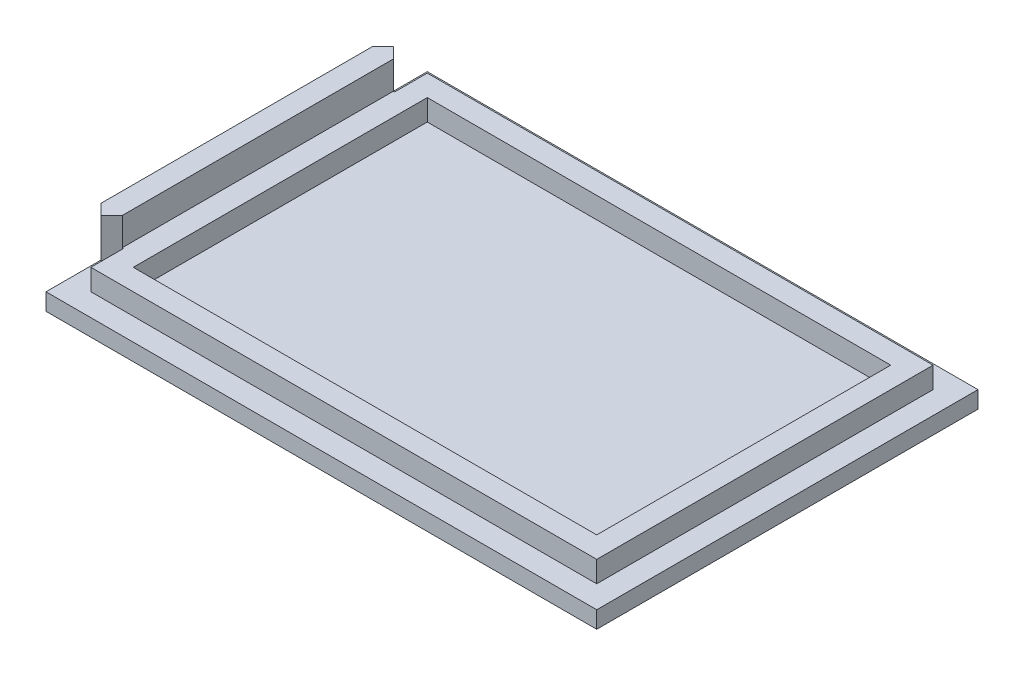
ISO-10303-21;
HEADER;
FILE_DESCRIPTION(('STEP AP214'),'2;1');
FILE_NAME('part.step','',(''),(''),'','','');
FILE_SCHEMA(('AUTOMOTIVE_DESIGN { 1 0 10303 214 1 1 1 1 }'));
ENDSEC;
DATA;
#1=APPLICATION_CONTEXT('core data for automotive mechanical design processes');
#2=APPLICATION_PROTOCOL_DEFINITION('international standard','automotive_design',2000,#1);
#3=PRODUCT_CONTEXT('',#1,'mechanical');
#4=PRODUCT('Part','Part','',(#3));
#5=PRODUCT_RELATED_PRODUCT_CATEGORY('part','',(#4));
#6=PRODUCT_DEFINITION_FORMATION('','',#4);
#7=PRODUCT_DEFINITION_CONTEXT('part definition',#1,'design');
#8=PRODUCT_DEFINITION('design','',#6,#7);
#9=PRODUCT_DEFINITION_SHAPE('','',#8);
#10=(LENGTH_UNIT() NAMED_UNIT(*) SI_UNIT(.MILLI.,.METRE.));
#11=(NAMED_UNIT(*) PLANE_ANGLE_UNIT() SI_UNIT($,.RADIAN.));
#12=(NAMED_UNIT(*) SI_UNIT($,.STERADIAN.) SOLID_ANGLE_UNIT());
#13=UNCERTAINTY_MEASURE_WITH_UNIT(LENGTH_MEASURE(1.E-05),#10,'distance_accuracy_value','');
#14=(GEOMETRIC_REPRESENTATION_CONTEXT(3) GLOBAL_UNCERTAINTY_ASSIGNED_CONTEXT((#13)) GLOBAL_UNIT_ASSIGNED_CONTEXT((#10,
#11,#12)) REPRESENTATION_CONTEXT('',''));
#15=CARTESIAN_POINT('',(0.,0.,0.));
#16=DIRECTION('',(0.,0.,1.));
#17=DIRECTION('',(1.,0.,0.));
#18=AXIS2_PLACEMENT_3D('',#15,#16,#17);
#19=CARTESIAN_POINT('',(0.,2.,0.));
#20=DIRECTION('',(0.,1.,0.));
#21=DIRECTION('',(0.,0.,1.));
#22=AXIS2_PLACEMENT_3D('',#19,#20,#21);
#23=PLANE('',#22);
#24=DIRECTION('',(0.707106781186546,0.,-0.707106781186548));
#25=VECTOR('',#24,1.);
#26=CARTESIAN_POINT('',(-31.25,2.,17.25));
#27=LINE('',#26,#25);
#28=CARTESIAN_POINT('',(-31.25,2.,17.25));
#29=VERTEX_POINT('',#28);
#30=CARTESIAN_POINT('',(-30.,2.,16.));
#31=VERTEX_POINT('',#30);
#32=EDGE_CURVE('E242',#29,#31,#27,.T.);
#33=ORIENTED_EDGE('',*,*,#32,.F.);
#34=DIRECTION('',(0.707106781186547,0.,0.707106781186547));
#35=VECTOR('',#34,1.);
#36=CARTESIAN_POINT('',(-32.5,2.,16.));
#37=LINE('',#36,#35);
#38=CARTESIAN_POINT('',(-32.5,2.,16.));
#39=VERTEX_POINT('',#38);
#40=EDGE_CURVE('E223',#39,#29,#37,.T.);
#41=ORIENTED_EDGE('',*,*,#40,.F.);
#42=DIRECTION('',(0.,0.,1.));
#43=VECTOR('',#42,1.);
#44=CARTESIAN_POINT('',(-32.5,2.,-22.5));
#45=LINE('',#44,#43);
#46=CARTESIAN_POINT('',(-32.5,2.,22.5));
#47=VERTEX_POINT('',#46);
#48=EDGE_CURVE('E314',#39,#47,#45,.T.);
#49=ORIENTED_EDGE('',*,*,#48,.T.);
#50=DIRECTION('',(1.,0.,0.));
#51=VECTOR('',#50,1.);
#52=CARTESIAN_POINT('',(-32.5,2.,22.5));
#53=LINE('',#52,#51);
#54=CARTESIAN_POINT('',(32.5,2.,22.5));
#55=VERTEX_POINT('',#54);
#56=EDGE_CURVE('E318',#47,#55,#53,.T.);
#57=ORIENTED_EDGE('',*,*,#56,.T.);
#58=DIRECTION('',(0.,0.,-1.));
#59=VECTOR('',#58,1.);
#60=CARTESIAN_POINT('',(32.5,2.,-22.5));
#61=LINE('',#60,#59);
#62=CARTESIAN_POINT('',(32.5,2.,-22.5));
#63=VERTEX_POINT('',#62);
#64=EDGE_CURVE('E308',#55,#63,#61,.T.);
#65=ORIENTED_EDGE('',*,*,#64,.T.);
#66=DIRECTION('',(-1.,0.,0.));
#67=VECTOR('',#66,1.);
#68=CARTESIAN_POINT('',(-32.5,2.,-22.5));
#69=LINE('',#68,#67);
#70=CARTESIAN_POINT('',(-32.5,2.,-22.5));
#71=VERTEX_POINT('',#70);
#72=EDGE_CURVE('E311',#63,#71,#69,.T.);
#73=ORIENTED_EDGE('',*,*,#72,.T.);
#74=CARTESIAN_POINT('',(-32.5,2.,-16.));
#75=VERTEX_POINT('',#74);
#76=EDGE_CURVE('E315',#71,#75,#45,.T.);
#77=ORIENTED_EDGE('',*,*,#76,.T.);
#78=DIRECTION('',(-0.707106781186546,0.,0.707106781186549));
#79=VECTOR('',#78,1.);
#80=CARTESIAN_POINT('',(-32.5,2.,-16.));
#81=LINE('',#80,#79);
#82=CARTESIAN_POINT('',(-31.25,2.,-17.25));
#83=VERTEX_POINT('',#82);
#84=EDGE_CURVE('E230',#83,#75,#81,.T.);
#85=ORIENTED_EDGE('',*,*,#84,.F.);
#86=DIRECTION('',(-0.707106781186549,0.,-0.707106781186547));
#87=VECTOR('',#86,1.);
#88=CARTESIAN_POINT('',(-31.25,2.,-17.25));
#89=LINE('',#88,#87);
#90=CARTESIAN_POINT('',(-30.,2.,-16.));
#91=VERTEX_POINT('',#90);
#92=EDGE_CURVE('E250',#91,#83,#89,.T.);
#93=ORIENTED_EDGE('',*,*,#92,.F.);
#94=DIRECTION('',(-1.,0.,0.));
#95=VECTOR('',#94,1.);
#96=CARTESIAN_POINT('',(-30.,2.,-16.));
#97=LINE('',#96,#95);
#98=CARTESIAN_POINT('',(-29.85,2.,-16.));
#99=VERTEX_POINT('',#98);
#100=EDGE_CURVE('E247',#99,#91,#97,.T.);
#101=ORIENTED_EDGE('',*,*,#100,.F.);
#102=DIRECTION('',(0.,0.,1.));
#103=VECTOR('',#102,1.);
#104=CARTESIAN_POINT('',(-29.85,2.,19.85));
#105=LINE('',#104,#103);
#106=CARTESIAN_POINT('',(-29.85,2.,-19.85));
#107=VERTEX_POINT('',#106);
#108=EDGE_CURVE('E292',#107,#99,#105,.T.);
#109=ORIENTED_EDGE('',*,*,#108,.F.);
#110=DIRECTION('',(-1.,0.,0.));
#111=VECTOR('',#110,1.);
#112=CARTESIAN_POINT('',(-29.85,2.,-19.85));
#113=LINE('',#112,#111);
#114=CARTESIAN_POINT('',(29.85,2.,-19.85));
#115=VERTEX_POINT('',#114);
#116=EDGE_CURVE('E288',#115,#107,#113,.T.);
#117=ORIENTED_EDGE('',*,*,#116,.F.);
#118=DIRECTION('',(0.,0.,-1.));
#119=VECTOR('',#118,1.);
#120=CARTESIAN_POINT('',(29.85,2.,19.85));
#121=LINE('',#120,#119);
#122=CARTESIAN_POINT('',(29.85,2.,19.85));
#123=VERTEX_POINT('',#122);
#124=EDGE_CURVE('E59',#123,#115,#121,.T.);
#125=ORIENTED_EDGE('',*,*,#124,.F.);
#126=DIRECTION('',(1.,0.,0.));
#127=VECTOR('',#126,1.);
#128=CARTESIAN_POINT('',(-29.85,2.,19.85));
#129=LINE('',#128,#127);
#130=CARTESIAN_POINT('',(-29.85,2.,19.85));
#131=VERTEX_POINT('',#130);
#132=EDGE_CURVE('E278',#131,#123,#129,.T.);
#133=ORIENTED_EDGE('',*,*,#132,.F.);
#134=CARTESIAN_POINT('',(-29.85,2.,16.));
#135=VERTEX_POINT('',#134);
#136=EDGE_CURVE('E291',#135,#131,#105,.T.);
#137=ORIENTED_EDGE('',*,*,#136,.F.);
#138=DIRECTION('',(1.,0.,0.));
#139=VECTOR('',#138,1.);
#140=CARTESIAN_POINT('',(-30.,2.,16.));
#141=LINE('',#140,#139);
#142=EDGE_CURVE('E245',#31,#135,#141,.T.);
#143=ORIENTED_EDGE('',*,*,#142,.F.);
#144=EDGE_LOOP('',(#33,#41,#49,#57,#65,#73,#77,#85,#93,#101,#109,#117,#125,#133,#137,#143));
#145=FACE_BOUND('',#144,.T.);
#146=ADVANCED_FACE('F36',(#145),#23,.T.);
#147=CARTESIAN_POINT('',(-29.85,4.5,19.85));
#148=DIRECTION('',(1.,0.,0.));
#149=DIRECTION('',(0.,0.,-1.));
#150=AXIS2_PLACEMENT_3D('',#147,#148,#149);
#151=PLANE('',#150);
#152=DIRECTION('',(0.,-1.,0.));
#153=VECTOR('',#152,1.);
#154=CARTESIAN_POINT('',(-29.85,7.8,16.));
#155=LINE('',#154,#153);
#156=CARTESIAN_POINT('',(-29.85,4.5,16.));
#157=VERTEX_POINT('',#156);
#158=EDGE_CURVE('E266',#157,#135,#155,.T.);
#159=ORIENTED_EDGE('',*,*,#158,.T.);
#160=ORIENTED_EDGE('',*,*,#136,.T.);
#161=DIRECTION('',(0.,-1.,0.));
#162=VECTOR('',#161,1.);
#163=CARTESIAN_POINT('',(-29.85,4.5,19.85));
#164=LINE('',#163,#162);
#165=CARTESIAN_POINT('',(-29.85,4.5,19.85));
#166=VERTEX_POINT('',#165);
#167=EDGE_CURVE('E298',#166,#131,#164,.T.);
#168=ORIENTED_EDGE('',*,*,#167,.F.);
#169=DIRECTION('',(0.,0.,1.));
#170=VECTOR('',#169,1.);
#171=CARTESIAN_POINT('',(-29.85,4.5,19.85));
#172=LINE('',#171,#170);
#173=EDGE_CURVE('E280',#157,#166,#172,.T.);
#174=ORIENTED_EDGE('',*,*,#173,.F.);
#175=EDGE_LOOP('',(#159,#160,#168,#174));
#176=FACE_BOUND('',#175,.T.);
#177=ADVANCED_FACE('F397',(#176),#151,.F.);
#178=DIRECTION('',(0.,-1.,0.));
#179=VECTOR('',#178,1.);
#180=CARTESIAN_POINT('',(-29.85,7.8,-16.));
#181=LINE('',#180,#179);
#182=CARTESIAN_POINT('',(-29.85,4.5,-16.));
#183=VERTEX_POINT('',#182);
#184=EDGE_CURVE('E264',#183,#99,#181,.T.);
#185=ORIENTED_EDGE('',*,*,#184,.F.);
#186=CARTESIAN_POINT('',(-29.85,4.5,-19.85));
#187=VERTEX_POINT('',#186);
#188=EDGE_CURVE('E281',#187,#183,#172,.T.);
#189=ORIENTED_EDGE('',*,*,#188,.F.);
#190=DIRECTION('',(0.,-1.,0.));
#191=VECTOR('',#190,1.);
#192=CARTESIAN_POINT('',(-29.85,4.5,-19.85));
#193=LINE('',#192,#191);
#194=EDGE_CURVE('E301',#187,#107,#193,.T.);
#195=ORIENTED_EDGE('',*,*,#194,.T.);
#196=ORIENTED_EDGE('',*,*,#108,.T.);
#197=EDGE_LOOP('',(#185,#189,#195,#196));
#198=FACE_BOUND('',#197,.T.);
#199=ADVANCED_FACE('F381',(#198),#151,.F.);
#200=CARTESIAN_POINT('',(32.5,2.,-22.5));
#201=DIRECTION('',(-1.,0.,0.));
#202=DIRECTION('',(0.,0.,1.));
#203=AXIS2_PLACEMENT_3D('',#200,#201,#202);
#204=PLANE('',#203);
#205=DIRECTION('',(0.,0.,-1.));
#206=VECTOR('',#205,1.);
#207=CARTESIAN_POINT('',(32.5,0.,-22.5));
#208=LINE('',#207,#206);
#209=CARTESIAN_POINT('',(32.5,0.,22.5));
#210=VERTEX_POINT('',#209);
#211=CARTESIAN_POINT('',(32.5,0.,-22.5));
#212=VERTEX_POINT('',#211);
#213=EDGE_CURVE('E307',#210,#212,#208,.T.);
#214=ORIENTED_EDGE('',*,*,#213,.T.);
#215=DIRECTION('',(0.,-1.,0.));
#216=VECTOR('',#215,1.);
#217=CARTESIAN_POINT('',(32.5,2.,-22.5));
#218=LINE('',#217,#216);
#219=EDGE_CURVE('E11',#63,#212,#218,.T.);
#220=ORIENTED_EDGE('',*,*,#219,.F.);
#221=ORIENTED_EDGE('',*,*,#64,.F.);
#222=DIRECTION('',(0.,-1.,0.));
#223=VECTOR('',#222,1.);
#224=CARTESIAN_POINT('',(32.5,2.,22.5));
#225=LINE('',#224,#223);
#226=EDGE_CURVE('E320',#55,#210,#225,.T.);
#227=ORIENTED_EDGE('',*,*,#226,.T.);
#228=EDGE_LOOP('',(#214,#220,#221,#227));
#229=FACE_BOUND('',#228,.T.);
#230=ADVANCED_FACE('F38',(#229),#204,.F.);
#231=CARTESIAN_POINT('',(-32.5,2.,-22.5));
#232=DIRECTION('',(0.,0.,1.));
#233=DIRECTION('',(1.,0.,0.));
#234=AXIS2_PLACEMENT_3D('',#231,#232,#233);
#235=PLANE('',#234);
#236=DIRECTION('',(-1.,0.,0.));
#237=VECTOR('',#236,1.);
#238=CARTESIAN_POINT('',(-32.5,0.,-22.5));
#239=LINE('',#238,#237);
#240=CARTESIAN_POINT('',(-32.5,0.,-22.5));
#241=VERTEX_POINT('',#240);
#242=EDGE_CURVE('E323',#212,#241,#239,.T.);
#243=ORIENTED_EDGE('',*,*,#242,.T.);
#244=DIRECTION('',(0.,-1.,0.));
#245=VECTOR('',#244,1.);
#246=CARTESIAN_POINT('',(-32.5,2.,-22.5));
#247=LINE('',#246,#245);
#248=EDGE_CURVE('E44',#71,#241,#247,.T.);
#249=ORIENTED_EDGE('',*,*,#248,.F.);
#250=ORIENTED_EDGE('',*,*,#72,.F.);
#251=ORIENTED_EDGE('',*,*,#219,.T.);
#252=EDGE_LOOP('',(#243,#249,#250,#251));
#253=FACE_BOUND('',#252,.T.);
#254=ADVANCED_FACE('F432',(#253),#235,.F.);
#255=CARTESIAN_POINT('',(-32.5,2.,-22.5));
#256=DIRECTION('',(1.,0.,0.));
#257=DIRECTION('',(0.,0.,-1.));
#258=AXIS2_PLACEMENT_3D('',#255,#256,#257);
#259=PLANE('',#258);
#260=DIRECTION('',(0.,0.,1.));
#261=VECTOR('',#260,1.);
#262=CARTESIAN_POINT('',(-32.5,0.,-22.5));
#263=LINE('',#262,#261);
#264=CARTESIAN_POINT('',(-32.5,0.,22.5));
#265=VERTEX_POINT('',#264);
#266=EDGE_CURVE('E325',#241,#265,#263,.T.);
#267=ORIENTED_EDGE('',*,*,#266,.T.);
#268=DIRECTION('',(0.,-1.,0.));
#269=VECTOR('',#268,1.);
#270=CARTESIAN_POINT('',(-32.5,2.,22.5));
#271=LINE('',#270,#269);
#272=EDGE_CURVE('E330',#47,#265,#271,.T.);
#273=ORIENTED_EDGE('',*,*,#272,.F.);
#274=ORIENTED_EDGE('',*,*,#48,.F.);
#275=DIRECTION('',(0.,-1.,0.));
#276=VECTOR('',#275,1.);
#277=CARTESIAN_POINT('',(-32.5,7.8,16.));
#278=LINE('',#277,#276);
#279=CARTESIAN_POINT('',(-32.5,7.8,16.));
#280=VERTEX_POINT('',#279);
#281=EDGE_CURVE('E239',#280,#39,#278,.T.);
#282=ORIENTED_EDGE('',*,*,#281,.F.);
#283=DIRECTION('',(0.,0.,1.));
#284=VECTOR('',#283,1.);
#285=CARTESIAN_POINT('',(-32.5,7.8,16.));
#286=LINE('',#285,#284);
#287=CARTESIAN_POINT('',(-32.5,7.8,-16.));
#288=VERTEX_POINT('',#287);
#289=EDGE_CURVE('E237',#288,#280,#286,.T.);
#290=ORIENTED_EDGE('',*,*,#289,.F.);
#291=DIRECTION('',(0.,-1.,0.));
#292=VECTOR('',#291,1.);
#293=CARTESIAN_POINT('',(-32.5,7.8,-16.));
#294=LINE('',#293,#292);
#295=EDGE_CURVE('E254',#288,#75,#294,.T.);
#296=ORIENTED_EDGE('',*,*,#295,.T.);
#297=ORIENTED_EDGE('',*,*,#76,.F.);
#298=ORIENTED_EDGE('',*,*,#248,.T.);
#299=EDGE_LOOP('',(#267,#273,#274,#282,#290,#296,#297,#298));
#300=FACE_BOUND('',#299,.T.);
#301=ADVANCED_FACE('F337',(#300),#259,.F.);
#302=CARTESIAN_POINT('',(-32.5,2.,22.5));
#303=DIRECTION('',(0.,0.,-1.));
#304=DIRECTION('',(-1.,0.,0.));
#305=AXIS2_PLACEMENT_3D('',#302,#303,#304);
#306=PLANE('',#305);
#307=DIRECTION('',(1.,0.,0.));
#308=VECTOR('',#307,1.);
#309=CARTESIAN_POINT('',(-32.5,0.,22.5));
#310=LINE('',#309,#308);
#311=EDGE_CURVE('E312',#265,#210,#310,.T.);
#312=ORIENTED_EDGE('',*,*,#311,.T.);
#313=ORIENTED_EDGE('',*,*,#226,.F.);
#314=ORIENTED_EDGE('',*,*,#56,.F.);
#315=ORIENTED_EDGE('',*,*,#272,.T.);
#316=EDGE_LOOP('',(#312,#313,#314,#315));
#317=FACE_BOUND('',#316,.T.);
#318=ADVANCED_FACE('F346',(#317),#306,.F.);
#319=CARTESIAN_POINT('',(0.,0.,0.));
#320=DIRECTION('',(0.,1.,0.));
#321=DIRECTION('',(0.,0.,1.));
#322=AXIS2_PLACEMENT_3D('',#319,#320,#321);
#323=PLANE('',#322);
#324=ORIENTED_EDGE('',*,*,#213,.F.);
#325=ORIENTED_EDGE('',*,*,#311,.F.);
#326=ORIENTED_EDGE('',*,*,#266,.F.);
#327=ORIENTED_EDGE('',*,*,#242,.F.);
#328=EDGE_LOOP('',(#324,#325,#326,#327));
#329=FACE_BOUND('',#328,.T.);
#330=ADVANCED_FACE('F343',(#329),#323,.F.);
#331=CARTESIAN_POINT('',(29.85,4.5,19.85));
#332=DIRECTION('',(-1.,0.,0.));
#333=DIRECTION('',(0.,0.,1.));
#334=AXIS2_PLACEMENT_3D('',#331,#332,#333);
#335=PLANE('',#334);
#336=ORIENTED_EDGE('',*,*,#124,.T.);
#337=DIRECTION('',(0.,-1.,0.));
#338=VECTOR('',#337,1.);
#339=CARTESIAN_POINT('',(29.85,4.5,-19.85));
#340=LINE('',#339,#338);
#341=CARTESIAN_POINT('',(29.85,4.5,-19.85));
#342=VERTEX_POINT('',#341);
#343=EDGE_CURVE('E304',#342,#115,#340,.T.);
#344=ORIENTED_EDGE('',*,*,#343,.F.);
#345=DIRECTION('',(0.,0.,-1.));
#346=VECTOR('',#345,1.);
#347=CARTESIAN_POINT('',(29.85,4.5,19.85));
#348=LINE('',#347,#346);
#349=CARTESIAN_POINT('',(29.85,4.5,19.85));
#350=VERTEX_POINT('',#349);
#351=EDGE_CURVE('E274',#350,#342,#348,.T.);
#352=ORIENTED_EDGE('',*,*,#351,.F.);
#353=DIRECTION('',(0.,-1.,0.));
#354=VECTOR('',#353,1.);
#355=CARTESIAN_POINT('',(29.85,4.5,19.85));
#356=LINE('',#355,#354);
#357=EDGE_CURVE('E286',#350,#123,#356,.T.);
#358=ORIENTED_EDGE('',*,*,#357,.T.);
#359=EDGE_LOOP('',(#336,#344,#352,#358));
#360=FACE_BOUND('',#359,.T.);
#361=ADVANCED_FACE('F388',(#360),#335,.F.);
#362=CARTESIAN_POINT('',(-29.85,4.5,-19.85));
#363=DIRECTION('',(0.,0.,1.));
#364=DIRECTION('',(1.,0.,0.));
#365=AXIS2_PLACEMENT_3D('',#362,#363,#364);
#366=PLANE('',#365);
#367=ORIENTED_EDGE('',*,*,#116,.T.);
#368=ORIENTED_EDGE('',*,*,#194,.F.);
#369=DIRECTION('',(-1.,0.,0.));
#370=VECTOR('',#369,1.);
#371=CARTESIAN_POINT('',(-29.85,4.5,-19.85));
#372=LINE('',#371,#370);
#373=EDGE_CURVE('E277',#342,#187,#372,.T.);
#374=ORIENTED_EDGE('',*,*,#373,.F.);
#375=ORIENTED_EDGE('',*,*,#343,.T.);
#376=EDGE_LOOP('',(#367,#368,#374,#375));
#377=FACE_BOUND('',#376,.T.);
#378=ADVANCED_FACE('F386',(#377),#366,.F.);
#379=CARTESIAN_POINT('',(-29.85,4.5,19.85));
#380=DIRECTION('',(0.,0.,-1.));
#381=DIRECTION('',(-1.,0.,0.));
#382=AXIS2_PLACEMENT_3D('',#379,#380,#381);
#383=PLANE('',#382);
#384=ORIENTED_EDGE('',*,*,#132,.T.);
#385=ORIENTED_EDGE('',*,*,#357,.F.);
#386=DIRECTION('',(1.,0.,0.));
#387=VECTOR('',#386,1.);
#388=CARTESIAN_POINT('',(-29.85,4.5,19.85));
#389=LINE('',#388,#387);
#390=EDGE_CURVE('E284',#166,#350,#389,.T.);
#391=ORIENTED_EDGE('',*,*,#390,.F.);
#392=ORIENTED_EDGE('',*,*,#167,.T.);
#393=EDGE_LOOP('',(#384,#385,#391,#392));
#394=FACE_BOUND('',#393,.T.);
#395=ADVANCED_FACE('F392',(#394),#383,.F.);
#396=CARTESIAN_POINT('',(0.,4.5,0.));
#397=DIRECTION('',(0.,-1.,0.));
#398=DIRECTION('',(0.,0.,-1.));
#399=AXIS2_PLACEMENT_3D('',#396,#397,#398);
#400=PLANE('',#399);
#401=DIRECTION('',(-1.,0.,0.));
#402=VECTOR('',#401,1.);
#403=CARTESIAN_POINT('',(-27.35,4.5,-17.35));
#404=LINE('',#403,#402);
#405=CARTESIAN_POINT('',(27.35,4.5,-17.35));
#406=VERTEX_POINT('',#405);
#407=CARTESIAN_POINT('',(-27.35,4.5,-17.35));
#408=VERTEX_POINT('',#407);
#409=EDGE_CURVE('E196',#406,#408,#404,.T.);
#410=ORIENTED_EDGE('',*,*,#409,.F.);
#411=DIRECTION('',(0.,0.,-1.));
#412=VECTOR('',#411,1.);
#413=CARTESIAN_POINT('',(27.35,4.5,17.35));
#414=LINE('',#413,#412);
#415=CARTESIAN_POINT('',(27.35,4.5,17.35));
#416=VERTEX_POINT('',#415);
#417=EDGE_CURVE('E51',#416,#406,#414,.T.);
#418=ORIENTED_EDGE('',*,*,#417,.F.);
#419=DIRECTION('',(1.,0.,0.));
#420=VECTOR('',#419,1.);
#421=CARTESIAN_POINT('',(-27.35,4.5,17.35));
#422=LINE('',#421,#420);
#423=CARTESIAN_POINT('',(-27.35,4.5,17.35));
#424=VERTEX_POINT('',#423);
#425=EDGE_CURVE('E203',#424,#416,#422,.T.);
#426=ORIENTED_EDGE('',*,*,#425,.F.);
#427=DIRECTION('',(0.,0.,1.));
#428=VECTOR('',#427,1.);
#429=CARTESIAN_POINT('',(-27.35,4.5,17.35));
#430=LINE('',#429,#428);
#431=EDGE_CURVE('E186',#408,#424,#430,.T.);
#432=ORIENTED_EDGE('',*,*,#431,.F.);
#433=EDGE_LOOP('',(#410,#418,#426,#432));
#434=FACE_BOUND('',#433,.T.);
#435=ORIENTED_EDGE('',*,*,#351,.T.);
#436=ORIENTED_EDGE('',*,*,#373,.T.);
#437=ORIENTED_EDGE('',*,*,#188,.T.);
#438=DIRECTION('',(-1.,0.,0.));
#439=VECTOR('',#438,1.);
#440=CARTESIAN_POINT('',(-29.85,4.5,-16.));
#441=LINE('',#440,#439);
#442=CARTESIAN_POINT('',(-30.,4.5,-16.));
#443=VERTEX_POINT('',#442);
#444=EDGE_CURVE('E217',#183,#443,#441,.T.);
#445=ORIENTED_EDGE('',*,*,#444,.T.);
#446=DIRECTION('',(0.,0.,1.));
#447=VECTOR('',#446,1.);
#448=CARTESIAN_POINT('',(-30.,4.5,-16.));
#449=LINE('',#448,#447);
#450=CARTESIAN_POINT('',(-30.,4.5,16.));
#451=VERTEX_POINT('',#450);
#452=EDGE_CURVE('E220',#443,#451,#449,.T.);
#453=ORIENTED_EDGE('',*,*,#452,.T.);
#454=DIRECTION('',(1.,0.,0.));
#455=VECTOR('',#454,1.);
#456=CARTESIAN_POINT('',(-29.85,4.5,16.));
#457=LINE('',#456,#455);
#458=EDGE_CURVE('E221',#451,#157,#457,.T.);
#459=ORIENTED_EDGE('',*,*,#458,.T.);
#460=ORIENTED_EDGE('',*,*,#173,.T.);
#461=ORIENTED_EDGE('',*,*,#390,.T.);
#462=EDGE_LOOP('',(#435,#436,#437,#445,#453,#459,#460,#461));
#463=FACE_BOUND('',#462,.T.);
#464=ADVANCED_FACE('F200',(#434,#463),#400,.F.);
#465=CARTESIAN_POINT('',(-32.5,7.8,16.));
#466=DIRECTION('',(0.707106781186548,0.,-0.707106781186548));
#467=DIRECTION('',(-0.707106781186548,0.,-0.707106781186548));
#468=AXIS2_PLACEMENT_3D('',#465,#466,#467);
#469=PLANE('',#468);
#470=ORIENTED_EDGE('',*,*,#40,.T.);
#471=DIRECTION('',(0.,-1.,0.));
#472=VECTOR('',#471,1.);
#473=CARTESIAN_POINT('',(-31.25,7.8,17.25));
#474=LINE('',#473,#472);
#475=CARTESIAN_POINT('',(-31.25,7.8,17.25));
#476=VERTEX_POINT('',#475);
#477=EDGE_CURVE('E272',#476,#29,#474,.T.);
#478=ORIENTED_EDGE('',*,*,#477,.F.);
#479=DIRECTION('',(0.707106781186547,0.,0.707106781186547));
#480=VECTOR('',#479,1.);
#481=CARTESIAN_POINT('',(-32.5,7.8,16.));
#482=LINE('',#481,#480);
#483=EDGE_CURVE('E226',#280,#476,#482,.T.);
#484=ORIENTED_EDGE('',*,*,#483,.F.);
#485=ORIENTED_EDGE('',*,*,#281,.T.);
#486=EDGE_LOOP('',(#470,#478,#484,#485));
#487=FACE_BOUND('',#486,.T.);
#488=ADVANCED_FACE('F359',(#487),#469,.F.);
#489=CARTESIAN_POINT('',(-31.25,7.8,17.25));
#490=DIRECTION('',(-0.707106781186548,0.,-0.707106781186547));
#491=DIRECTION('',(-0.707106781186547,0.,0.707106781186548));
#492=AXIS2_PLACEMENT_3D('',#489,#490,#491);
#493=PLANE('',#492);
#494=ORIENTED_EDGE('',*,*,#32,.T.);
#495=DIRECTION('',(0.,-1.,0.));
#496=VECTOR('',#495,1.);
#497=CARTESIAN_POINT('',(-30.,7.8,16.));
#498=LINE('',#497,#496);
#499=EDGE_CURVE('E269',#451,#31,#498,.T.);
#500=ORIENTED_EDGE('',*,*,#499,.F.);
#501=CARTESIAN_POINT('',(-30.,7.8,16.));
#502=VERTEX_POINT('',#501);
#503=EDGE_CURVE('E270',#502,#451,#498,.T.);
#504=ORIENTED_EDGE('',*,*,#503,.F.);
#505=DIRECTION('',(0.707106781186546,0.,-0.707106781186548));
#506=VECTOR('',#505,1.);
#507=CARTESIAN_POINT('',(-31.25,7.8,17.25));
#508=LINE('',#507,#506);
#509=EDGE_CURVE('E229',#476,#502,#508,.T.);
#510=ORIENTED_EDGE('',*,*,#509,.F.);
#511=ORIENTED_EDGE('',*,*,#477,.T.);
#512=EDGE_LOOP('',(#494,#500,#504,#510,#511));
#513=FACE_BOUND('',#512,.T.);
#514=ADVANCED_FACE('F405',(#513),#493,.F.);
#515=CARTESIAN_POINT('',(-30.,7.8,16.));
#516=DIRECTION('',(0.,0.,-1.));
#517=DIRECTION('',(-1.,0.,0.));
#518=AXIS2_PLACEMENT_3D('',#515,#516,#517);
#519=PLANE('',#518);
#520=ORIENTED_EDGE('',*,*,#158,.F.);
#521=ORIENTED_EDGE('',*,*,#458,.F.);
#522=ORIENTED_EDGE('',*,*,#499,.T.);
#523=ORIENTED_EDGE('',*,*,#142,.T.);
#524=EDGE_LOOP('',(#520,#521,#522,#523));
#525=FACE_BOUND('',#524,.T.);
#526=ADVANCED_FACE('F402',(#525),#519,.F.);
#527=CARTESIAN_POINT('',(-30.,7.8,-16.));
#528=DIRECTION('',(0.,0.,1.));
#529=DIRECTION('',(1.,0.,0.));
#530=AXIS2_PLACEMENT_3D('',#527,#528,#529);
#531=PLANE('',#530);
#532=DIRECTION('',(0.,-1.,0.));
#533=VECTOR('',#532,1.);
#534=CARTESIAN_POINT('',(-30.,7.8,-16.));
#535=LINE('',#534,#533);
#536=EDGE_CURVE('E260',#443,#91,#535,.T.);
#537=ORIENTED_EDGE('',*,*,#536,.F.);
#538=ORIENTED_EDGE('',*,*,#444,.F.);
#539=ORIENTED_EDGE('',*,*,#184,.T.);
#540=ORIENTED_EDGE('',*,*,#100,.T.);
#541=EDGE_LOOP('',(#537,#538,#539,#540));
#542=FACE_BOUND('',#541,.T.);
#543=ADVANCED_FACE('F377',(#542),#531,.F.);
#544=CARTESIAN_POINT('',(-31.25,7.8,-17.25));
#545=DIRECTION('',(-0.707106781186547,0.,0.707106781186549));
#546=DIRECTION('',(0.707106781186549,0.,0.707106781186547));
#547=AXIS2_PLACEMENT_3D('',#544,#545,#546);
#548=PLANE('',#547);
#549=ORIENTED_EDGE('',*,*,#92,.T.);
#550=DIRECTION('',(0.,-1.,0.));
#551=VECTOR('',#550,1.);
#552=CARTESIAN_POINT('',(-31.25,7.8,-17.25));
#553=LINE('',#552,#551);
#554=CARTESIAN_POINT('',(-31.25,7.8,-17.25));
#555=VERTEX_POINT('',#554);
#556=EDGE_CURVE('E257',#555,#83,#553,.T.);
#557=ORIENTED_EDGE('',*,*,#556,.F.);
#558=DIRECTION('',(-0.707106781186549,0.,-0.707106781186547));
#559=VECTOR('',#558,1.);
#560=CARTESIAN_POINT('',(-31.25,7.8,-17.25));
#561=LINE('',#560,#559);
#562=CARTESIAN_POINT('',(-30.,7.8,-16.));
#563=VERTEX_POINT('',#562);
#564=EDGE_CURVE('E233',#563,#555,#561,.T.);
#565=ORIENTED_EDGE('',*,*,#564,.F.);
#566=EDGE_CURVE('E261',#563,#443,#535,.T.);
#567=ORIENTED_EDGE('',*,*,#566,.T.);
#568=ORIENTED_EDGE('',*,*,#536,.T.);
#569=EDGE_LOOP('',(#549,#557,#565,#567,#568));
#570=FACE_BOUND('',#569,.T.);
#571=ADVANCED_FACE('F374',(#570),#548,.F.);
#572=CARTESIAN_POINT('',(-32.5,7.8,-16.));
#573=DIRECTION('',(0.707106781186549,0.,0.707106781186546));
#574=DIRECTION('',(0.707106781186546,0.,-0.707106781186549));
#575=AXIS2_PLACEMENT_3D('',#572,#573,#574);
#576=PLANE('',#575);
#577=ORIENTED_EDGE('',*,*,#84,.T.);
#578=ORIENTED_EDGE('',*,*,#295,.F.);
#579=DIRECTION('',(-0.707106781186546,0.,0.707106781186549));
#580=VECTOR('',#579,1.);
#581=CARTESIAN_POINT('',(-32.5,7.8,-16.));
#582=LINE('',#581,#580);
#583=EDGE_CURVE('E235',#555,#288,#582,.T.);
#584=ORIENTED_EDGE('',*,*,#583,.F.);
#585=ORIENTED_EDGE('',*,*,#556,.T.);
#586=EDGE_LOOP('',(#577,#578,#584,#585));
#587=FACE_BOUND('',#586,.T.);
#588=ADVANCED_FACE('F369',(#587),#576,.F.);
#589=CARTESIAN_POINT('',(0.,7.8,0.));
#590=DIRECTION('',(0.,1.,0.));
#591=DIRECTION('',(0.,0.,1.));
#592=AXIS2_PLACEMENT_3D('',#589,#590,#591);
#593=PLANE('',#592);
#594=DIRECTION('',(0.,0.,1.));
#595=VECTOR('',#594,1.);
#596=CARTESIAN_POINT('',(-30.,7.8,-16.));
#597=LINE('',#596,#595);
#598=EDGE_CURVE('E214',#563,#502,#597,.T.);
#599=ORIENTED_EDGE('',*,*,#598,.F.);
#600=ORIENTED_EDGE('',*,*,#564,.T.);
#601=ORIENTED_EDGE('',*,*,#583,.T.);
#602=ORIENTED_EDGE('',*,*,#289,.T.);
#603=ORIENTED_EDGE('',*,*,#483,.T.);
#604=ORIENTED_EDGE('',*,*,#509,.T.);
#605=EDGE_LOOP('',(#599,#600,#601,#602,#603,#604));
#606=FACE_BOUND('',#605,.T.);
#607=ADVANCED_FACE('F362',(#606),#593,.T.);
#608=CARTESIAN_POINT('',(-30.,-27.5003515605688,-16.));
#609=DIRECTION('',(-1.,0.,0.));
#610=DIRECTION('',(0.,0.,1.));
#611=AXIS2_PLACEMENT_3D('',#608,#609,#610);
#612=PLANE('',#611);
#613=ORIENTED_EDGE('',*,*,#566,.F.);
#614=ORIENTED_EDGE('',*,*,#598,.T.);
#615=ORIENTED_EDGE('',*,*,#503,.T.);
#616=ORIENTED_EDGE('',*,*,#452,.F.);
#617=EDGE_LOOP('',(#613,#614,#615,#616));
#618=FACE_BOUND('',#617,.T.);
#619=ADVANCED_FACE('F407',(#618),#612,.F.);
#620=CARTESIAN_POINT('',(27.35,-62.7779283398288,17.35));
#621=DIRECTION('',(1.,0.,0.));
#622=DIRECTION('',(0.,0.,-1.));
#623=AXIS2_PLACEMENT_3D('',#620,#621,#622);
#624=PLANE('',#623);
#625=DIRECTION('',(0.,0.,1.));
#626=VECTOR('',#625,1.);
#627=CARTESIAN_POINT('',(27.35,2.,17.35));
#628=LINE('',#627,#626);
#629=CARTESIAN_POINT('',(27.35,2.,-17.35));
#630=VERTEX_POINT('',#629);
#631=CARTESIAN_POINT('',(27.35,2.,17.35));
#632=VERTEX_POINT('',#631);
#633=EDGE_CURVE('E215',#630,#632,#628,.T.);
#634=ORIENTED_EDGE('',*,*,#633,.T.);
#635=DIRECTION('',(0.,1.,0.));
#636=VECTOR('',#635,1.);
#637=CARTESIAN_POINT('',(27.35,-62.7779283398288,17.35));
#638=LINE('',#637,#636);
#639=EDGE_CURVE('E208',#632,#416,#638,.T.);
#640=ORIENTED_EDGE('',*,*,#639,.T.);
#641=ORIENTED_EDGE('',*,*,#417,.T.);
#642=DIRECTION('',(0.,1.,0.));
#643=VECTOR('',#642,1.);
#644=CARTESIAN_POINT('',(27.35,-62.7779283398288,-17.35));
#645=LINE('',#644,#643);
#646=EDGE_CURVE('E193',#630,#406,#645,.T.);
#647=ORIENTED_EDGE('',*,*,#646,.F.);
#648=EDGE_LOOP('',(#634,#640,#641,#647));
#649=FACE_BOUND('',#648,.T.);
#650=ADVANCED_FACE('F409',(#649),#624,.F.);
#651=CARTESIAN_POINT('',(-27.35,-62.7779283398288,17.35));
#652=DIRECTION('',(0.,0.,1.));
#653=DIRECTION('',(1.,0.,0.));
#654=AXIS2_PLACEMENT_3D('',#651,#652,#653);
#655=PLANE('',#654);
#656=DIRECTION('',(-1.,0.,0.));
#657=VECTOR('',#656,1.);
#658=CARTESIAN_POINT('',(-27.35,2.,17.35));
#659=LINE('',#658,#657);
#660=CARTESIAN_POINT('',(-27.35,2.,17.35));
#661=VERTEX_POINT('',#660);
#662=EDGE_CURVE('E590',#632,#661,#659,.T.);
#663=ORIENTED_EDGE('',*,*,#662,.T.);
#664=DIRECTION('',(0.,1.,0.));
#665=VECTOR('',#664,1.);
#666=CARTESIAN_POINT('',(-27.35,-62.7779283398288,17.35));
#667=LINE('',#666,#665);
#668=EDGE_CURVE('E192',#661,#424,#667,.T.);
#669=ORIENTED_EDGE('',*,*,#668,.T.);
#670=ORIENTED_EDGE('',*,*,#425,.T.);
#671=ORIENTED_EDGE('',*,*,#639,.F.);
#672=EDGE_LOOP('',(#663,#669,#670,#671));
#673=FACE_BOUND('',#672,.T.);
#674=ADVANCED_FACE('F415',(#673),#655,.F.);
#675=CARTESIAN_POINT('',(-27.35,-62.7779283398288,17.35));
#676=DIRECTION('',(-1.,0.,0.));
#677=DIRECTION('',(0.,0.,1.));
#678=AXIS2_PLACEMENT_3D('',#675,#676,#677);
#679=PLANE('',#678);
#680=DIRECTION('',(0.,0.,-1.));
#681=VECTOR('',#680,1.);
#682=CARTESIAN_POINT('',(-27.35,2.,17.35));
#683=LINE('',#682,#681);
#684=CARTESIAN_POINT('',(-27.35,2.,-17.35));
#685=VERTEX_POINT('',#684);
#686=EDGE_CURVE('E189',#661,#685,#683,.T.);
#687=ORIENTED_EDGE('',*,*,#686,.T.);
#688=DIRECTION('',(0.,1.,0.));
#689=VECTOR('',#688,1.);
#690=CARTESIAN_POINT('',(-27.35,-62.7779283398288,-17.35));
#691=LINE('',#690,#689);
#692=EDGE_CURVE('E181',#685,#408,#691,.T.);
#693=ORIENTED_EDGE('',*,*,#692,.T.);
#694=ORIENTED_EDGE('',*,*,#431,.T.);
#695=ORIENTED_EDGE('',*,*,#668,.F.);
#696=EDGE_LOOP('',(#687,#693,#694,#695));
#697=FACE_BOUND('',#696,.T.);
#698=ADVANCED_FACE('F183',(#697),#679,.F.);
#699=CARTESIAN_POINT('',(-27.35,-62.7779283398288,-17.35));
#700=DIRECTION('',(0.,0.,-1.));
#701=DIRECTION('',(-1.,0.,0.));
#702=AXIS2_PLACEMENT_3D('',#699,#700,#701);
#703=PLANE('',#702);
#704=DIRECTION('',(1.,0.,0.));
#705=VECTOR('',#704,1.);
#706=CARTESIAN_POINT('',(-27.35,2.,-17.35));
#707=LINE('',#706,#705);
#708=EDGE_CURVE('E212',#685,#630,#707,.T.);
#709=ORIENTED_EDGE('',*,*,#708,.T.);
#710=ORIENTED_EDGE('',*,*,#646,.T.);
#711=ORIENTED_EDGE('',*,*,#409,.T.);
#712=ORIENTED_EDGE('',*,*,#692,.F.);
#713=EDGE_LOOP('',(#709,#710,#711,#712));
#714=FACE_BOUND('',#713,.T.);
#715=ADVANCED_FACE('F197',(#714),#703,.F.);
#716=CARTESIAN_POINT('',(0.,2.,0.));
#717=DIRECTION('',(0.,1.,0.));
#718=DIRECTION('',(0.,0.,1.));
#719=AXIS2_PLACEMENT_3D('',#716,#717,#718);
#720=PLANE('',#719);
#721=ORIENTED_EDGE('',*,*,#633,.F.);
#722=ORIENTED_EDGE('',*,*,#708,.F.);
#723=ORIENTED_EDGE('',*,*,#686,.F.);
#724=ORIENTED_EDGE('',*,*,#662,.F.);
#725=EDGE_LOOP('',(#721,#722,#723,#724));
#726=FACE_BOUND('',#725,.T.);
#727=ADVANCED_FACE('F575',(#726),#720,.T.);
#728=CLOSED_SHELL('',(#146,#177,#199,#230,#254,#301,#318,#330,#361,#378,#395,#464,#488,#514,
#526,#543,#571,#588,#607,#619,#650,#674,#698,#715,#727));
#729=MANIFOLD_SOLID_BREP('B2',#728);
#730=ADVANCED_BREP_SHAPE_REPRESENTATION('',(#18,#729),#14);
#731=SHAPE_DEFINITION_REPRESENTATION(#9,#730);
ENDSEC;
END-ISO-10303-21;
